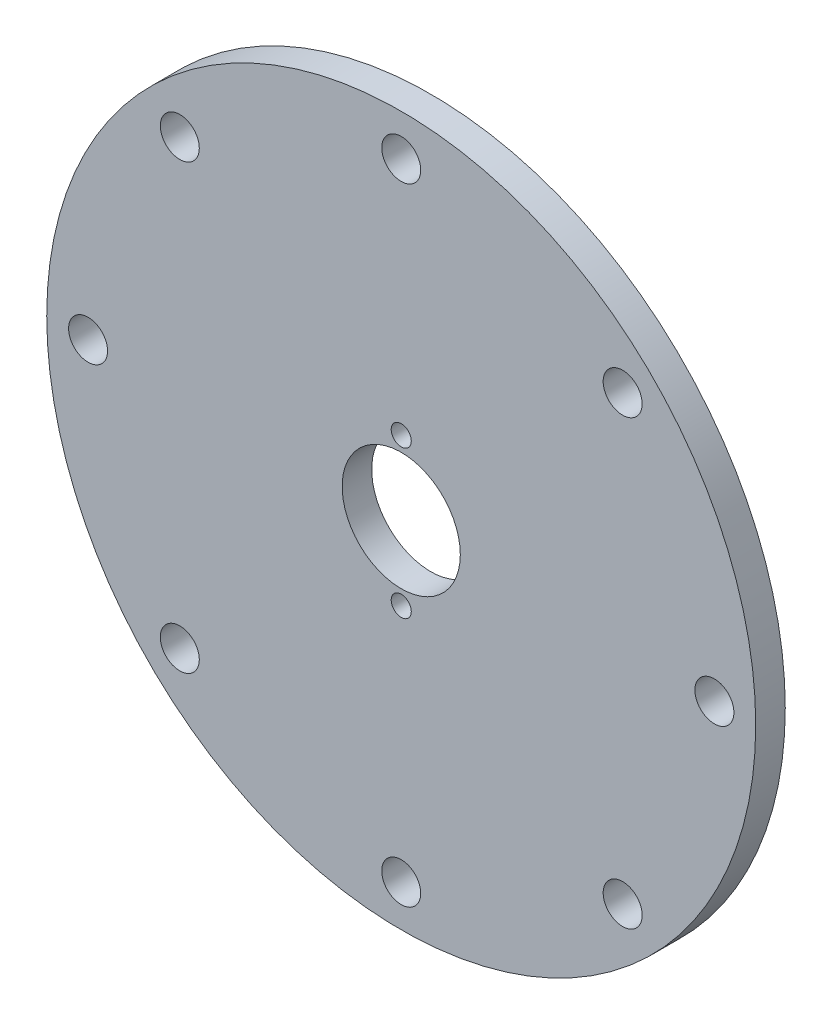
ISO-10303-21;
HEADER;
FILE_DESCRIPTION(('STEP AP214'),'2;1');
FILE_NAME('part.step','',(''),(''),'','','');
FILE_SCHEMA(('AUTOMOTIVE_DESIGN { 1 0 10303 214 1 1 1 1 }'));
ENDSEC;
DATA;
#1=APPLICATION_CONTEXT('core data for automotive mechanical design processes');
#2=APPLICATION_PROTOCOL_DEFINITION('international standard','automotive_design',2000,#1);
#3=PRODUCT_CONTEXT('',#1,'mechanical');
#4=PRODUCT('Part','Part','',(#3));
#5=PRODUCT_RELATED_PRODUCT_CATEGORY('part','',(#4));
#6=PRODUCT_DEFINITION_FORMATION('','',#4);
#7=PRODUCT_DEFINITION_CONTEXT('part definition',#1,'design');
#8=PRODUCT_DEFINITION('design','',#6,#7);
#9=PRODUCT_DEFINITION_SHAPE('','',#8);
#10=(LENGTH_UNIT() NAMED_UNIT(*) SI_UNIT(.MILLI.,.METRE.));
#11=(NAMED_UNIT(*) PLANE_ANGLE_UNIT() SI_UNIT($,.RADIAN.));
#12=(NAMED_UNIT(*) SI_UNIT($,.STERADIAN.) SOLID_ANGLE_UNIT());
#13=UNCERTAINTY_MEASURE_WITH_UNIT(LENGTH_MEASURE(1.E-05),#10,'distance_accuracy_value','');
#14=(GEOMETRIC_REPRESENTATION_CONTEXT(3) GLOBAL_UNCERTAINTY_ASSIGNED_CONTEXT((#13)) GLOBAL_UNIT_ASSIGNED_CONTEXT((#10,
#11,#12)) REPRESENTATION_CONTEXT('',''));
#15=CARTESIAN_POINT('',(0.,0.,0.));
#16=DIRECTION('',(0.,0.,1.));
#17=DIRECTION('',(1.,0.,0.));
#18=AXIS2_PLACEMENT_3D('',#15,#16,#17);
#19=CARTESIAN_POINT('',(0.,0.,5.));
#20=DIRECTION('',(0.,0.,-1.));
#21=DIRECTION('',(-1.,0.,0.));
#22=AXIS2_PLACEMENT_3D('',#19,#20,#21);
#23=CYLINDRICAL_SURFACE('',#22,60.);
#24=CARTESIAN_POINT('',(0.,0.,5.));
#25=DIRECTION('',(0.,0.,1.));
#26=DIRECTION('',(1.,0.,0.));
#27=AXIS2_PLACEMENT_3D('',#24,#25,#26);
#28=CIRCLE('',#27,60.);
#29=CARTESIAN_POINT('',(60.,0.,5.));
#30=VERTEX_POINT('',#29);
#31=EDGE_CURVE('E10',#30,#30,#28,.T.);
#32=ORIENTED_EDGE('',*,*,#31,.F.);
#33=EDGE_LOOP('',(#32));
#34=FACE_BOUND('',#33,.T.);
#35=CARTESIAN_POINT('',(0.,0.,0.));
#36=DIRECTION('',(0.,0.,1.));
#37=DIRECTION('',(1.,0.,0.));
#38=AXIS2_PLACEMENT_3D('',#35,#36,#37);
#39=CIRCLE('',#38,60.);
#40=CARTESIAN_POINT('',(60.,0.,0.));
#41=VERTEX_POINT('',#40);
#42=EDGE_CURVE('E48',#41,#41,#39,.T.);
#43=ORIENTED_EDGE('',*,*,#42,.T.);
#44=EDGE_LOOP('',(#43));
#45=FACE_BOUND('',#44,.T.);
#46=ADVANCED_FACE('F45',(#34,#45),#23,.T.);
#47=CARTESIAN_POINT('',(0.,0.,5.));
#48=DIRECTION('',(0.,0.,1.));
#49=DIRECTION('',(1.,0.,0.));
#50=AXIS2_PLACEMENT_3D('',#47,#48,#49);
#51=PLANE('',#50);
#52=CARTESIAN_POINT('',(0.,53.,5.));
#53=DIRECTION('',(0.,0.,1.));
#54=DIRECTION('',(1.,0.,0.));
#55=AXIS2_PLACEMENT_3D('',#52,#53,#54);
#56=CIRCLE('',#55,3.3);
#57=CARTESIAN_POINT('',(3.3,53.,5.));
#58=VERTEX_POINT('',#57);
#59=EDGE_CURVE('E142',#58,#58,#56,.T.);
#60=ORIENTED_EDGE('',*,*,#59,.F.);
#61=EDGE_LOOP('',(#60));
#62=FACE_BOUND('',#61,.T.);
#63=CARTESIAN_POINT('',(37.476659402887,37.476659402887,5.));
#64=DIRECTION('',(0.,0.,1.));
#65=DIRECTION('',(1.,0.,0.));
#66=AXIS2_PLACEMENT_3D('',#63,#64,#65);
#67=CIRCLE('',#66,3.3);
#68=CARTESIAN_POINT('',(40.776659402887,37.476659402887,5.));
#69=VERTEX_POINT('',#68);
#70=EDGE_CURVE('E134',#69,#69,#67,.T.);
#71=ORIENTED_EDGE('',*,*,#70,.F.);
#72=EDGE_LOOP('',(#71));
#73=FACE_BOUND('',#72,.T.);
#74=CARTESIAN_POINT('',(53.,0.,5.));
#75=DIRECTION('',(0.,0.,1.));
#76=DIRECTION('',(1.,0.,0.));
#77=AXIS2_PLACEMENT_3D('',#74,#75,#76);
#78=CIRCLE('',#77,3.3);
#79=CARTESIAN_POINT('',(56.3,0.,5.));
#80=VERTEX_POINT('',#79);
#81=EDGE_CURVE('E126',#80,#80,#78,.T.);
#82=ORIENTED_EDGE('',*,*,#81,.F.);
#83=EDGE_LOOP('',(#82));
#84=FACE_BOUND('',#83,.T.);
#85=CARTESIAN_POINT('',(37.476659402887,-37.476659402887,5.));
#86=DIRECTION('',(0.,0.,1.));
#87=DIRECTION('',(1.,0.,0.));
#88=AXIS2_PLACEMENT_3D('',#85,#86,#87);
#89=CIRCLE('',#88,3.3);
#90=CARTESIAN_POINT('',(40.776659402887,-37.476659402887,5.));
#91=VERTEX_POINT('',#90);
#92=EDGE_CURVE('E118',#91,#91,#89,.T.);
#93=ORIENTED_EDGE('',*,*,#92,.F.);
#94=EDGE_LOOP('',(#93));
#95=FACE_BOUND('',#94,.T.);
#96=CARTESIAN_POINT('',(0.,-53.,5.));
#97=DIRECTION('',(0.,0.,1.));
#98=DIRECTION('',(1.,0.,0.));
#99=AXIS2_PLACEMENT_3D('',#96,#97,#98);
#100=CIRCLE('',#99,3.3);
#101=CARTESIAN_POINT('',(3.30000000000001,-53.,5.));
#102=VERTEX_POINT('',#101);
#103=EDGE_CURVE('E110',#102,#102,#100,.T.);
#104=ORIENTED_EDGE('',*,*,#103,.F.);
#105=EDGE_LOOP('',(#104));
#106=FACE_BOUND('',#105,.T.);
#107=CARTESIAN_POINT('',(-37.476659402887,-37.476659402887,5.));
#108=DIRECTION('',(0.,0.,1.));
#109=DIRECTION('',(1.,0.,0.));
#110=AXIS2_PLACEMENT_3D('',#107,#108,#109);
#111=CIRCLE('',#110,3.3);
#112=CARTESIAN_POINT('',(-34.176659402887,-37.476659402887,5.));
#113=VERTEX_POINT('',#112);
#114=EDGE_CURVE('E102',#113,#113,#111,.T.);
#115=ORIENTED_EDGE('',*,*,#114,.F.);
#116=EDGE_LOOP('',(#115));
#117=FACE_BOUND('',#116,.T.);
#118=CARTESIAN_POINT('',(-53.,0.,5.));
#119=DIRECTION('',(0.,0.,1.));
#120=DIRECTION('',(1.,0.,0.));
#121=AXIS2_PLACEMENT_3D('',#118,#119,#120);
#122=CIRCLE('',#121,3.3);
#123=CARTESIAN_POINT('',(-49.7,0.,5.));
#124=VERTEX_POINT('',#123);
#125=EDGE_CURVE('E94',#124,#124,#122,.T.);
#126=ORIENTED_EDGE('',*,*,#125,.F.);
#127=EDGE_LOOP('',(#126));
#128=FACE_BOUND('',#127,.T.);
#129=CARTESIAN_POINT('',(-37.476659402887,37.476659402887,5.));
#130=DIRECTION('',(0.,0.,1.));
#131=DIRECTION('',(1.,0.,0.));
#132=AXIS2_PLACEMENT_3D('',#129,#130,#131);
#133=CIRCLE('',#132,3.3);
#134=CARTESIAN_POINT('',(-34.176659402887,37.476659402887,5.));
#135=VERTEX_POINT('',#134);
#136=EDGE_CURVE('E86',#135,#135,#133,.T.);
#137=ORIENTED_EDGE('',*,*,#136,.F.);
#138=EDGE_LOOP('',(#137));
#139=FACE_BOUND('',#138,.T.);
#140=CARTESIAN_POINT('',(0.,12.5,5.));
#141=DIRECTION('',(0.,0.,1.));
#142=DIRECTION('',(1.,0.,0.));
#143=AXIS2_PLACEMENT_3D('',#140,#141,#142);
#144=CIRCLE('',#143,1.7);
#145=CARTESIAN_POINT('',(1.7,12.5,5.));
#146=VERTEX_POINT('',#145);
#147=EDGE_CURVE('E78',#146,#146,#144,.T.);
#148=ORIENTED_EDGE('',*,*,#147,.F.);
#149=EDGE_LOOP('',(#148));
#150=FACE_BOUND('',#149,.T.);
#151=CARTESIAN_POINT('',(0.,-12.5,5.));
#152=DIRECTION('',(0.,0.,1.));
#153=DIRECTION('',(1.,0.,0.));
#154=AXIS2_PLACEMENT_3D('',#151,#152,#153);
#155=CIRCLE('',#154,1.7);
#156=CARTESIAN_POINT('',(1.7,-12.5,5.));
#157=VERTEX_POINT('',#156);
#158=EDGE_CURVE('E70',#157,#157,#155,.T.);
#159=ORIENTED_EDGE('',*,*,#158,.F.);
#160=EDGE_LOOP('',(#159));
#161=FACE_BOUND('',#160,.T.);
#162=CARTESIAN_POINT('',(0.,0.,5.));
#163=DIRECTION('',(0.,0.,1.));
#164=DIRECTION('',(1.,0.,0.));
#165=AXIS2_PLACEMENT_3D('',#162,#163,#164);
#166=CIRCLE('',#165,10.);
#167=CARTESIAN_POINT('',(10.,0.,5.));
#168=VERTEX_POINT('',#167);
#169=EDGE_CURVE('E57',#168,#168,#166,.T.);
#170=ORIENTED_EDGE('',*,*,#169,.F.);
#171=EDGE_LOOP('',(#170));
#172=FACE_BOUND('',#171,.T.);
#173=ORIENTED_EDGE('',*,*,#31,.T.);
#174=EDGE_LOOP('',(#173));
#175=FACE_BOUND('',#174,.T.);
#176=ADVANCED_FACE('F149',(#62,#73,#84,#95,#106,#117,#128,#139,#150,#161,#172,#175),#51,.T.);
#177=CARTESIAN_POINT('',(0.,0.,0.));
#178=DIRECTION('',(0.,0.,1.));
#179=DIRECTION('',(1.,0.,0.));
#180=AXIS2_PLACEMENT_3D('',#177,#178,#179);
#181=PLANE('',#180);
#182=CARTESIAN_POINT('',(0.,53.,0.));
#183=DIRECTION('',(0.,0.,1.));
#184=DIRECTION('',(1.,0.,0.));
#185=AXIS2_PLACEMENT_3D('',#182,#183,#184);
#186=CIRCLE('',#185,3.3);
#187=CARTESIAN_POINT('',(3.3,53.,0.));
#188=VERTEX_POINT('',#187);
#189=EDGE_CURVE('E138',#188,#188,#186,.T.);
#190=ORIENTED_EDGE('',*,*,#189,.T.);
#191=EDGE_LOOP('',(#190));
#192=FACE_BOUND('',#191,.T.);
#193=CARTESIAN_POINT('',(37.476659402887,37.476659402887,0.));
#194=DIRECTION('',(0.,0.,1.));
#195=DIRECTION('',(1.,0.,0.));
#196=AXIS2_PLACEMENT_3D('',#193,#194,#195);
#197=CIRCLE('',#196,3.3);
#198=CARTESIAN_POINT('',(40.776659402887,37.476659402887,0.));
#199=VERTEX_POINT('',#198);
#200=EDGE_CURVE('E130',#199,#199,#197,.T.);
#201=ORIENTED_EDGE('',*,*,#200,.T.);
#202=EDGE_LOOP('',(#201));
#203=FACE_BOUND('',#202,.T.);
#204=CARTESIAN_POINT('',(53.,0.,0.));
#205=DIRECTION('',(0.,0.,1.));
#206=DIRECTION('',(1.,0.,0.));
#207=AXIS2_PLACEMENT_3D('',#204,#205,#206);
#208=CIRCLE('',#207,3.3);
#209=CARTESIAN_POINT('',(56.3,0.,0.));
#210=VERTEX_POINT('',#209);
#211=EDGE_CURVE('E122',#210,#210,#208,.T.);
#212=ORIENTED_EDGE('',*,*,#211,.T.);
#213=EDGE_LOOP('',(#212));
#214=FACE_BOUND('',#213,.T.);
#215=CARTESIAN_POINT('',(37.476659402887,-37.476659402887,0.));
#216=DIRECTION('',(0.,0.,1.));
#217=DIRECTION('',(1.,0.,0.));
#218=AXIS2_PLACEMENT_3D('',#215,#216,#217);
#219=CIRCLE('',#218,3.3);
#220=CARTESIAN_POINT('',(40.776659402887,-37.476659402887,0.));
#221=VERTEX_POINT('',#220);
#222=EDGE_CURVE('E114',#221,#221,#219,.T.);
#223=ORIENTED_EDGE('',*,*,#222,.T.);
#224=EDGE_LOOP('',(#223));
#225=FACE_BOUND('',#224,.T.);
#226=CARTESIAN_POINT('',(0.,-53.,0.));
#227=DIRECTION('',(0.,0.,1.));
#228=DIRECTION('',(1.,0.,0.));
#229=AXIS2_PLACEMENT_3D('',#226,#227,#228);
#230=CIRCLE('',#229,3.3);
#231=CARTESIAN_POINT('',(3.30000000000001,-53.,0.));
#232=VERTEX_POINT('',#231);
#233=EDGE_CURVE('E106',#232,#232,#230,.T.);
#234=ORIENTED_EDGE('',*,*,#233,.T.);
#235=EDGE_LOOP('',(#234));
#236=FACE_BOUND('',#235,.T.);
#237=CARTESIAN_POINT('',(-37.476659402887,-37.476659402887,0.));
#238=DIRECTION('',(0.,0.,1.));
#239=DIRECTION('',(1.,0.,0.));
#240=AXIS2_PLACEMENT_3D('',#237,#238,#239);
#241=CIRCLE('',#240,3.3);
#242=CARTESIAN_POINT('',(-34.176659402887,-37.476659402887,0.));
#243=VERTEX_POINT('',#242);
#244=EDGE_CURVE('E98',#243,#243,#241,.T.);
#245=ORIENTED_EDGE('',*,*,#244,.T.);
#246=EDGE_LOOP('',(#245));
#247=FACE_BOUND('',#246,.T.);
#248=CARTESIAN_POINT('',(-53.,0.,0.));
#249=DIRECTION('',(0.,0.,1.));
#250=DIRECTION('',(1.,0.,0.));
#251=AXIS2_PLACEMENT_3D('',#248,#249,#250);
#252=CIRCLE('',#251,3.3);
#253=CARTESIAN_POINT('',(-49.7,0.,0.));
#254=VERTEX_POINT('',#253);
#255=EDGE_CURVE('E90',#254,#254,#252,.T.);
#256=ORIENTED_EDGE('',*,*,#255,.T.);
#257=EDGE_LOOP('',(#256));
#258=FACE_BOUND('',#257,.T.);
#259=CARTESIAN_POINT('',(-37.476659402887,37.476659402887,0.));
#260=DIRECTION('',(0.,0.,1.));
#261=DIRECTION('',(1.,0.,0.));
#262=AXIS2_PLACEMENT_3D('',#259,#260,#261);
#263=CIRCLE('',#262,3.3);
#264=CARTESIAN_POINT('',(-34.176659402887,37.476659402887,0.));
#265=VERTEX_POINT('',#264);
#266=EDGE_CURVE('E82',#265,#265,#263,.T.);
#267=ORIENTED_EDGE('',*,*,#266,.T.);
#268=EDGE_LOOP('',(#267));
#269=FACE_BOUND('',#268,.T.);
#270=CARTESIAN_POINT('',(0.,12.5,0.));
#271=DIRECTION('',(0.,0.,1.));
#272=DIRECTION('',(1.,0.,0.));
#273=AXIS2_PLACEMENT_3D('',#270,#271,#272);
#274=CIRCLE('',#273,1.7);
#275=CARTESIAN_POINT('',(1.7,12.5,0.));
#276=VERTEX_POINT('',#275);
#277=EDGE_CURVE('E74',#276,#276,#274,.T.);
#278=ORIENTED_EDGE('',*,*,#277,.T.);
#279=EDGE_LOOP('',(#278));
#280=FACE_BOUND('',#279,.T.);
#281=CARTESIAN_POINT('',(0.,-12.5,0.));
#282=DIRECTION('',(0.,0.,1.));
#283=DIRECTION('',(1.,0.,0.));
#284=AXIS2_PLACEMENT_3D('',#281,#282,#283);
#285=CIRCLE('',#284,1.7);
#286=CARTESIAN_POINT('',(1.7,-12.5,0.));
#287=VERTEX_POINT('',#286);
#288=EDGE_CURVE('E66',#287,#287,#285,.T.);
#289=ORIENTED_EDGE('',*,*,#288,.T.);
#290=EDGE_LOOP('',(#289));
#291=FACE_BOUND('',#290,.T.);
#292=CARTESIAN_POINT('',(0.,0.,0.));
#293=DIRECTION('',(0.,0.,1.));
#294=DIRECTION('',(1.,0.,0.));
#295=AXIS2_PLACEMENT_3D('',#292,#293,#294);
#296=CIRCLE('',#295,10.);
#297=CARTESIAN_POINT('',(10.,0.,0.));
#298=VERTEX_POINT('',#297);
#299=EDGE_CURVE('E62',#298,#298,#296,.T.);
#300=ORIENTED_EDGE('',*,*,#299,.T.);
#301=EDGE_LOOP('',(#300));
#302=FACE_BOUND('',#301,.T.);
#303=ORIENTED_EDGE('',*,*,#42,.F.);
#304=EDGE_LOOP('',(#303));
#305=FACE_BOUND('',#304,.T.);
#306=ADVANCED_FACE('F152',(#192,#203,#214,#225,#236,#247,#258,#269,#280,#291,#302,#305),#181,.F.);
#307=CARTESIAN_POINT('',(0.,0.,0.));
#308=DIRECTION('',(0.,0.,1.));
#309=DIRECTION('',(1.,0.,0.));
#310=AXIS2_PLACEMENT_3D('',#307,#308,#309);
#311=CYLINDRICAL_SURFACE('',#310,10.);
#312=ORIENTED_EDGE('',*,*,#169,.T.);
#313=EDGE_LOOP('',(#312));
#314=FACE_BOUND('',#313,.T.);
#315=ORIENTED_EDGE('',*,*,#299,.F.);
#316=EDGE_LOOP('',(#315));
#317=FACE_BOUND('',#316,.T.);
#318=ADVANCED_FACE('F174',(#314,#317),#311,.F.);
#319=CARTESIAN_POINT('',(0.,-12.5,5.));
#320=DIRECTION('',(0.,0.,1.));
#321=DIRECTION('',(1.,0.,0.));
#322=AXIS2_PLACEMENT_3D('',#319,#320,#321);
#323=CYLINDRICAL_SURFACE('',#322,1.7);
#324=ORIENTED_EDGE('',*,*,#288,.F.);
#325=EDGE_LOOP('',(#324));
#326=FACE_BOUND('',#325,.T.);
#327=ORIENTED_EDGE('',*,*,#158,.T.);
#328=EDGE_LOOP('',(#327));
#329=FACE_BOUND('',#328,.T.);
#330=ADVANCED_FACE('F177',(#326,#329),#323,.F.);
#331=CARTESIAN_POINT('',(0.,12.5,5.));
#332=DIRECTION('',(0.,0.,1.));
#333=DIRECTION('',(1.,0.,0.));
#334=AXIS2_PLACEMENT_3D('',#331,#332,#333);
#335=CYLINDRICAL_SURFACE('',#334,1.7);
#336=ORIENTED_EDGE('',*,*,#277,.F.);
#337=EDGE_LOOP('',(#336));
#338=FACE_BOUND('',#337,.T.);
#339=ORIENTED_EDGE('',*,*,#147,.T.);
#340=EDGE_LOOP('',(#339));
#341=FACE_BOUND('',#340,.T.);
#342=ADVANCED_FACE('F204',(#338,#341),#335,.F.);
#343=CARTESIAN_POINT('',(-37.476659402887,37.476659402887,5.));
#344=DIRECTION('',(0.,0.,1.));
#345=DIRECTION('',(1.,0.,0.));
#346=AXIS2_PLACEMENT_3D('',#343,#344,#345);
#347=CYLINDRICAL_SURFACE('',#346,3.3);
#348=ORIENTED_EDGE('',*,*,#266,.F.);
#349=EDGE_LOOP('',(#348));
#350=FACE_BOUND('',#349,.T.);
#351=ORIENTED_EDGE('',*,*,#136,.T.);
#352=EDGE_LOOP('',(#351));
#353=FACE_BOUND('',#352,.T.);
#354=ADVANCED_FACE('F212',(#350,#353),#347,.F.);
#355=CARTESIAN_POINT('',(-53.,0.,5.));
#356=DIRECTION('',(0.,0.,1.));
#357=DIRECTION('',(1.,0.,0.));
#358=AXIS2_PLACEMENT_3D('',#355,#356,#357);
#359=CYLINDRICAL_SURFACE('',#358,3.3);
#360=ORIENTED_EDGE('',*,*,#255,.F.);
#361=EDGE_LOOP('',(#360));
#362=FACE_BOUND('',#361,.T.);
#363=ORIENTED_EDGE('',*,*,#125,.T.);
#364=EDGE_LOOP('',(#363));
#365=FACE_BOUND('',#364,.T.);
#366=ADVANCED_FACE('F230',(#362,#365),#359,.F.);
#367=CARTESIAN_POINT('',(-37.476659402887,-37.476659402887,5.));
#368=DIRECTION('',(0.,0.,1.));
#369=DIRECTION('',(1.,0.,0.));
#370=AXIS2_PLACEMENT_3D('',#367,#368,#369);
#371=CYLINDRICAL_SURFACE('',#370,3.3);
#372=ORIENTED_EDGE('',*,*,#244,.F.);
#373=EDGE_LOOP('',(#372));
#374=FACE_BOUND('',#373,.T.);
#375=ORIENTED_EDGE('',*,*,#114,.T.);
#376=EDGE_LOOP('',(#375));
#377=FACE_BOUND('',#376,.T.);
#378=ADVANCED_FACE('F239',(#374,#377),#371,.F.);
#379=CARTESIAN_POINT('',(0.,-53.,5.));
#380=DIRECTION('',(0.,0.,1.));
#381=DIRECTION('',(1.,0.,0.));
#382=AXIS2_PLACEMENT_3D('',#379,#380,#381);
#383=CYLINDRICAL_SURFACE('',#382,3.3);
#384=ORIENTED_EDGE('',*,*,#233,.F.);
#385=EDGE_LOOP('',(#384));
#386=FACE_BOUND('',#385,.T.);
#387=ORIENTED_EDGE('',*,*,#103,.T.);
#388=EDGE_LOOP('',(#387));
#389=FACE_BOUND('',#388,.T.);
#390=ADVANCED_FACE('F248',(#386,#389),#383,.F.);
#391=CARTESIAN_POINT('',(37.476659402887,-37.476659402887,5.));
#392=DIRECTION('',(0.,0.,1.));
#393=DIRECTION('',(1.,0.,0.));
#394=AXIS2_PLACEMENT_3D('',#391,#392,#393);
#395=CYLINDRICAL_SURFACE('',#394,3.3);
#396=ORIENTED_EDGE('',*,*,#222,.F.);
#397=EDGE_LOOP('',(#396));
#398=FACE_BOUND('',#397,.T.);
#399=ORIENTED_EDGE('',*,*,#92,.T.);
#400=EDGE_LOOP('',(#399));
#401=FACE_BOUND('',#400,.T.);
#402=ADVANCED_FACE('F257',(#398,#401),#395,.F.);
#403=CARTESIAN_POINT('',(53.,0.,5.));
#404=DIRECTION('',(0.,0.,1.));
#405=DIRECTION('',(1.,0.,0.));
#406=AXIS2_PLACEMENT_3D('',#403,#404,#405);
#407=CYLINDRICAL_SURFACE('',#406,3.3);
#408=ORIENTED_EDGE('',*,*,#211,.F.);
#409=EDGE_LOOP('',(#408));
#410=FACE_BOUND('',#409,.T.);
#411=ORIENTED_EDGE('',*,*,#81,.T.);
#412=EDGE_LOOP('',(#411));
#413=FACE_BOUND('',#412,.T.);
#414=ADVANCED_FACE('F266',(#410,#413),#407,.F.);
#415=CARTESIAN_POINT('',(37.476659402887,37.476659402887,5.));
#416=DIRECTION('',(0.,0.,1.));
#417=DIRECTION('',(1.,0.,0.));
#418=AXIS2_PLACEMENT_3D('',#415,#416,#417);
#419=CYLINDRICAL_SURFACE('',#418,3.3);
#420=ORIENTED_EDGE('',*,*,#200,.F.);
#421=EDGE_LOOP('',(#420));
#422=FACE_BOUND('',#421,.T.);
#423=ORIENTED_EDGE('',*,*,#70,.T.);
#424=EDGE_LOOP('',(#423));
#425=FACE_BOUND('',#424,.T.);
#426=ADVANCED_FACE('F275',(#422,#425),#419,.F.);
#427=CARTESIAN_POINT('',(0.,53.,5.));
#428=DIRECTION('',(0.,0.,1.));
#429=DIRECTION('',(1.,0.,0.));
#430=AXIS2_PLACEMENT_3D('',#427,#428,#429);
#431=CYLINDRICAL_SURFACE('',#430,3.3);
#432=ORIENTED_EDGE('',*,*,#189,.F.);
#433=EDGE_LOOP('',(#432));
#434=FACE_BOUND('',#433,.T.);
#435=ORIENTED_EDGE('',*,*,#59,.T.);
#436=EDGE_LOOP('',(#435));
#437=FACE_BOUND('',#436,.T.);
#438=ADVANCED_FACE('F147',(#434,#437),#431,.F.);
#439=CLOSED_SHELL('',(#46,#176,#306,#318,#330,#342,#354,#366,#378,#390,#402,#414,#426,#438));
#440=MANIFOLD_SOLID_BREP('B2',#439);
#441=ADVANCED_BREP_SHAPE_REPRESENTATION('',(#18,#440),#14);
#442=SHAPE_DEFINITION_REPRESENTATION(#9,#441);
ENDSEC;
END-ISO-10303-21;
